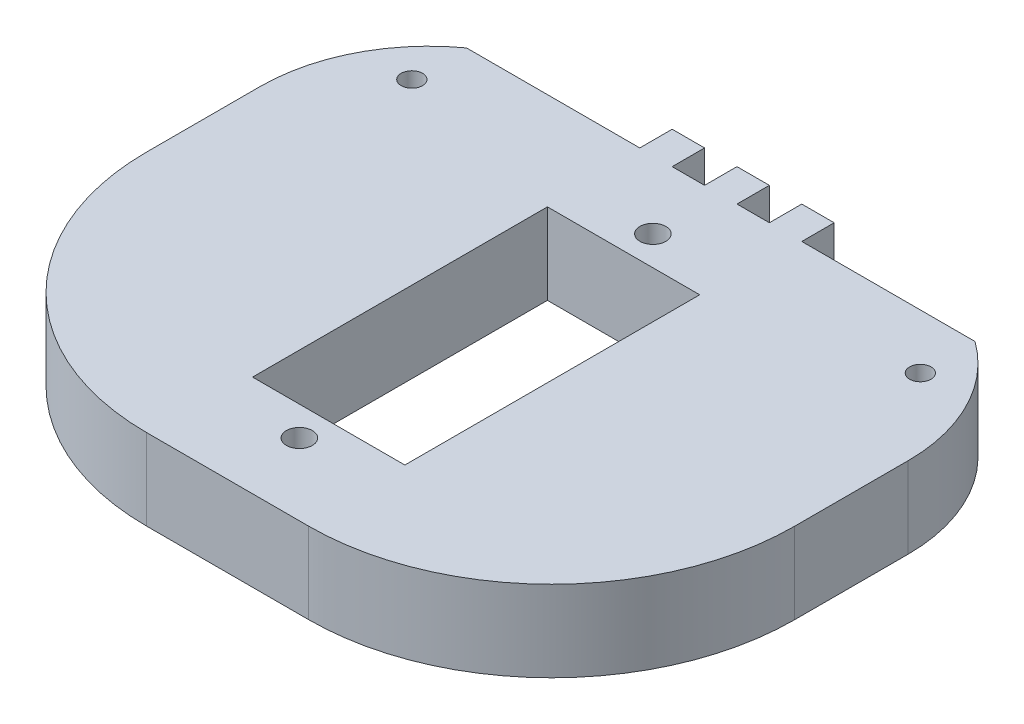
ISO-10303-21;
HEADER;
FILE_DESCRIPTION(('STEP AP214'),'2;1');
FILE_NAME('part.step','',(''),(''),'','','');
FILE_SCHEMA(('AUTOMOTIVE_DESIGN { 1 0 10303 214 1 1 1 1 }'));
ENDSEC;
DATA;
#1=APPLICATION_CONTEXT('core data for automotive mechanical design processes');
#2=APPLICATION_PROTOCOL_DEFINITION('international standard','automotive_design',2000,#1);
#3=PRODUCT_CONTEXT('',#1,'mechanical');
#4=PRODUCT('Part','Part','',(#3));
#5=PRODUCT_RELATED_PRODUCT_CATEGORY('part','',(#4));
#6=PRODUCT_DEFINITION_FORMATION('','',#4);
#7=PRODUCT_DEFINITION_CONTEXT('part definition',#1,'design');
#8=PRODUCT_DEFINITION('design','',#6,#7);
#9=PRODUCT_DEFINITION_SHAPE('','',#8);
#10=(LENGTH_UNIT() NAMED_UNIT(*) SI_UNIT(.MILLI.,.METRE.));
#11=(NAMED_UNIT(*) PLANE_ANGLE_UNIT() SI_UNIT($,.RADIAN.));
#12=(NAMED_UNIT(*) SI_UNIT($,.STERADIAN.) SOLID_ANGLE_UNIT());
#13=UNCERTAINTY_MEASURE_WITH_UNIT(LENGTH_MEASURE(1.E-05),#10,'distance_accuracy_value','');
#14=(GEOMETRIC_REPRESENTATION_CONTEXT(3) GLOBAL_UNCERTAINTY_ASSIGNED_CONTEXT((#13)) GLOBAL_UNIT_ASSIGNED_CONTEXT((#10,
#11,#12)) REPRESENTATION_CONTEXT('',''));
#15=CARTESIAN_POINT('',(0.,0.,0.));
#16=DIRECTION('',(0.,0.,1.));
#17=DIRECTION('',(1.,0.,0.));
#18=AXIS2_PLACEMENT_3D('',#15,#16,#17);
#19=CARTESIAN_POINT('',(37.5729287006509,6.35,-21.5900000000006));
#20=DIRECTION('',(0.,1.,0.));
#21=DIRECTION('',(0.,0.,1.));
#22=AXIS2_PLACEMENT_3D('',#19,#20,#21);
#23=PLANE('',#22);
#24=CARTESIAN_POINT('',(25.4,6.35,-26.983791346));
#25=DIRECTION('',(0.,1.,0.));
#26=DIRECTION('',(0.,0.,1.));
#27=AXIS2_PLACEMENT_3D('',#24,#25,#26);
#28=CIRCLE('',#27,1.016);
#29=CARTESIAN_POINT('',(25.4,6.35,-25.967791346));
#30=VERTEX_POINT('',#29);
#31=EDGE_CURVE('E737',#30,#30,#28,.T.);
#32=ORIENTED_EDGE('',*,*,#31,.F.);
#33=EDGE_LOOP('',(#32));
#34=FACE_BOUND('',#33,.T.);
#35=CARTESIAN_POINT('',(45.3298254592818,6.35,-28.017571346));
#36=DIRECTION('',(0.,1.,0.));
#37=DIRECTION('',(0.,0.,1.));
#38=AXIS2_PLACEMENT_3D('',#35,#36,#37);
#39=CIRCLE('',#38,0.840105000000002);
#40=CARTESIAN_POINT('',(45.3298254592818,6.35,-27.177466346));
#41=VERTEX_POINT('',#40);
#42=EDGE_CURVE('E224',#41,#41,#39,.T.);
#43=ORIENTED_EDGE('',*,*,#42,.F.);
#44=EDGE_LOOP('',(#43));
#45=FACE_BOUND('',#44,.T.);
#46=DIRECTION('',(-1.,0.,0.));
#47=VECTOR('',#46,1.);
#48=CARTESIAN_POINT('',(29.21,6.35,-34.843821346));
#49=LINE('',#48,#47);
#50=CARTESIAN_POINT('',(31.75,6.35,-34.843821346));
#51=VERTEX_POINT('',#50);
#52=CARTESIAN_POINT('',(29.21,6.35,-34.843821346));
#53=VERTEX_POINT('',#52);
#54=EDGE_CURVE('E234',#51,#53,#49,.T.);
#55=ORIENTED_EDGE('',*,*,#54,.T.);
#56=DIRECTION('',(0.,0.,1.));
#57=VECTOR('',#56,1.);
#58=CARTESIAN_POINT('',(29.21,6.35,-32.303821346));
#59=LINE('',#58,#57);
#60=CARTESIAN_POINT('',(29.21,6.35,-32.303821346));
#61=VERTEX_POINT('',#60);
#62=EDGE_CURVE('E237',#53,#61,#59,.T.);
#63=ORIENTED_EDGE('',*,*,#62,.T.);
#64=DIRECTION('',(-1.,0.,0.));
#65=VECTOR('',#64,1.);
#66=CARTESIAN_POINT('',(26.67,6.35,-32.303821346));
#67=LINE('',#66,#65);
#68=CARTESIAN_POINT('',(26.67,6.35,-32.303821346));
#69=VERTEX_POINT('',#68);
#70=EDGE_CURVE('E240',#61,#69,#67,.T.);
#71=ORIENTED_EDGE('',*,*,#70,.T.);
#72=DIRECTION('',(0.,0.,-1.));
#73=VECTOR('',#72,1.);
#74=CARTESIAN_POINT('',(26.67,6.35,-34.843821346));
#75=LINE('',#74,#73);
#76=CARTESIAN_POINT('',(26.67,6.35,-34.843821346));
#77=VERTEX_POINT('',#76);
#78=EDGE_CURVE('E242',#69,#77,#75,.T.);
#79=ORIENTED_EDGE('',*,*,#78,.T.);
#80=DIRECTION('',(-1.,0.,0.));
#81=VECTOR('',#80,1.);
#82=CARTESIAN_POINT('',(24.13,6.35,-34.843821346));
#83=LINE('',#82,#81);
#84=CARTESIAN_POINT('',(24.13,6.35,-34.843821346));
#85=VERTEX_POINT('',#84);
#86=EDGE_CURVE('E244',#77,#85,#83,.T.);
#87=ORIENTED_EDGE('',*,*,#86,.T.);
#88=DIRECTION('',(0.,0.,1.));
#89=VECTOR('',#88,1.);
#90=CARTESIAN_POINT('',(24.13,6.35,-34.843821346));
#91=LINE('',#90,#89);
#92=CARTESIAN_POINT('',(24.13,6.35,-32.303821346));
#93=VERTEX_POINT('',#92);
#94=EDGE_CURVE('E246',#85,#93,#91,.T.);
#95=ORIENTED_EDGE('',*,*,#94,.T.);
#96=DIRECTION('',(-1.,0.,0.));
#97=VECTOR('',#96,1.);
#98=CARTESIAN_POINT('',(24.13,6.35,-32.303821346));
#99=LINE('',#98,#97);
#100=CARTESIAN_POINT('',(21.59,6.35,-32.303821346));
#101=VERTEX_POINT('',#100);
#102=EDGE_CURVE('E248',#93,#101,#99,.T.);
#103=ORIENTED_EDGE('',*,*,#102,.T.);
#104=DIRECTION('',(0.,0.,-1.));
#105=VECTOR('',#104,1.);
#106=CARTESIAN_POINT('',(21.59,6.35,-32.303821346));
#107=LINE('',#106,#105);
#108=CARTESIAN_POINT('',(21.59,6.35,-34.843821346));
#109=VERTEX_POINT('',#108);
#110=EDGE_CURVE('E250',#101,#109,#107,.T.);
#111=ORIENTED_EDGE('',*,*,#110,.T.);
#112=DIRECTION('',(-1.,0.,0.));
#113=VECTOR('',#112,1.);
#114=CARTESIAN_POINT('',(21.59,6.35,-34.843821346));
#115=LINE('',#114,#113);
#116=CARTESIAN_POINT('',(19.05,6.35,-34.843821346));
#117=VERTEX_POINT('',#116);
#118=EDGE_CURVE('E252',#109,#117,#115,.T.);
#119=ORIENTED_EDGE('',*,*,#118,.T.);
#120=DIRECTION('',(0.,0.,1.));
#121=VECTOR('',#120,1.);
#122=CARTESIAN_POINT('',(19.05,6.35,-34.843821346));
#123=LINE('',#122,#121);
#124=CARTESIAN_POINT('',(19.05,6.35,-32.303821346));
#125=VERTEX_POINT('',#124);
#126=EDGE_CURVE('E254',#117,#125,#123,.T.);
#127=ORIENTED_EDGE('',*,*,#126,.T.);
#128=DIRECTION('',(-1.,0.,0.));
#129=VECTOR('',#128,1.);
#130=CARTESIAN_POINT('',(19.05,6.35,-32.303821346));
#131=LINE('',#130,#129);
#132=CARTESIAN_POINT('',(5.47017454071819,6.35,-32.303821346));
#133=VERTEX_POINT('',#132);
#134=EDGE_CURVE('E256',#125,#133,#131,.T.);
#135=ORIENTED_EDGE('',*,*,#134,.T.);
#136=CARTESIAN_POINT('',(13.227071299349,6.35,-21.59));
#137=DIRECTION('',(0.,1.,0.));
#138=DIRECTION('',(0.,0.,-1.));
#139=AXIS2_PLACEMENT_3D('',#136,#137,#138);
#140=CIRCLE('',#139,13.227071299349);
#141=CARTESIAN_POINT('',(0.,6.35,-21.59));
#142=VERTEX_POINT('',#141);
#143=EDGE_CURVE('E258',#133,#142,#140,.T.);
#144=ORIENTED_EDGE('',*,*,#143,.T.);
#145=DIRECTION('',(0.,0.,1.));
#146=VECTOR('',#145,1.);
#147=CARTESIAN_POINT('',(0.,6.35,-12.7));
#148=LINE('',#147,#146);
#149=CARTESIAN_POINT('',(0.,6.35,-12.7));
#150=VERTEX_POINT('',#149);
#151=EDGE_CURVE('E260',#142,#150,#148,.T.);
#152=ORIENTED_EDGE('',*,*,#151,.T.);
#153=CARTESIAN_POINT('',(19.05,6.35,-12.7));
#154=DIRECTION('',(0.,1.,0.));
#155=DIRECTION('',(0.,0.,1.));
#156=AXIS2_PLACEMENT_3D('',#153,#154,#155);
#157=CIRCLE('',#156,19.05);
#158=CARTESIAN_POINT('',(19.05,6.35,6.34999999999996));
#159=VERTEX_POINT('',#158);
#160=EDGE_CURVE('E262',#150,#159,#157,.T.);
#161=ORIENTED_EDGE('',*,*,#160,.T.);
#162=DIRECTION('',(1.,0.,0.));
#163=VECTOR('',#162,1.);
#164=CARTESIAN_POINT('',(19.0500000000001,6.35,6.34999999999996));
#165=LINE('',#164,#163);
#166=CARTESIAN_POINT('',(31.75,6.35,6.35));
#167=VERTEX_POINT('',#166);
#168=EDGE_CURVE('E264',#159,#167,#165,.T.);
#169=ORIENTED_EDGE('',*,*,#168,.T.);
#170=CARTESIAN_POINT('',(31.75,6.35,-12.7));
#171=DIRECTION('',(0.,1.,0.));
#172=DIRECTION('',(0.,0.,1.));
#173=AXIS2_PLACEMENT_3D('',#170,#171,#172);
#174=CIRCLE('',#173,19.05);
#175=CARTESIAN_POINT('',(50.8,6.35,-12.7000000000006));
#176=VERTEX_POINT('',#175);
#177=EDGE_CURVE('E266',#167,#176,#174,.T.);
#178=ORIENTED_EDGE('',*,*,#177,.T.);
#179=DIRECTION('',(0.,0.,-1.));
#180=VECTOR('',#179,1.);
#181=CARTESIAN_POINT('',(50.8,6.35,-12.7000000000006));
#182=LINE('',#181,#180);
#183=CARTESIAN_POINT('',(50.8,6.35,-21.5900000000006));
#184=VERTEX_POINT('',#183);
#185=EDGE_CURVE('E268',#176,#184,#182,.T.);
#186=ORIENTED_EDGE('',*,*,#185,.T.);
#187=CARTESIAN_POINT('',(37.5729287006509,6.35,-21.5900000000006));
#188=DIRECTION('',(0.,1.,0.));
#189=DIRECTION('',(0.,0.,1.));
#190=AXIS2_PLACEMENT_3D('',#187,#188,#189);
#191=CIRCLE('',#190,13.2270712993491);
#192=CARTESIAN_POINT('',(45.3298254592818,6.35,-32.3038213460006));
#193=VERTEX_POINT('',#192);
#194=EDGE_CURVE('E270',#184,#193,#191,.T.);
#195=ORIENTED_EDGE('',*,*,#194,.T.);
#196=DIRECTION('',(-1.,0.,0.));
#197=VECTOR('',#196,1.);
#198=CARTESIAN_POINT('',(31.75,6.35,-32.3038213460006));
#199=LINE('',#198,#197);
#200=CARTESIAN_POINT('',(31.75,6.35,-32.3038213460006));
#201=VERTEX_POINT('',#200);
#202=EDGE_CURVE('E272',#193,#201,#199,.T.);
#203=ORIENTED_EDGE('',*,*,#202,.T.);
#204=DIRECTION('',(0.,0.,-1.));
#205=VECTOR('',#204,1.);
#206=CARTESIAN_POINT('',(31.75,6.35,-34.843821346));
#207=LINE('',#206,#205);
#208=EDGE_CURVE('E274',#201,#51,#207,.T.);
#209=ORIENTED_EDGE('',*,*,#208,.T.);
#210=EDGE_LOOP('',(#55,#63,#71,#79,#87,#95,#103,#111,#119,#127,#135,#144,#152,#161,#169,#178,
#186,#195,#203,#209));
#211=FACE_BOUND('',#210,.T.);
#212=DIRECTION('',(0.,0.,-1.));
#213=VECTOR('',#212,1.);
#214=CARTESIAN_POINT('',(31.369,6.35,-1.569821346));
#215=LINE('',#214,#213);
#216=CARTESIAN_POINT('',(31.369,6.35,-1.569821346));
#217=VERTEX_POINT('',#216);
#218=CARTESIAN_POINT('',(31.369,6.35,-24.683821346));
#219=VERTEX_POINT('',#218);
#220=EDGE_CURVE('E202',#217,#219,#215,.T.);
#221=ORIENTED_EDGE('',*,*,#220,.F.);
#222=DIRECTION('',(1.,0.,0.));
#223=VECTOR('',#222,1.);
#224=CARTESIAN_POINT('',(19.431,6.35,-1.569821346));
#225=LINE('',#224,#223);
#226=CARTESIAN_POINT('',(19.431,6.35,-1.569821346));
#227=VERTEX_POINT('',#226);
#228=EDGE_CURVE('E194',#227,#217,#225,.T.);
#229=ORIENTED_EDGE('',*,*,#228,.F.);
#230=DIRECTION('',(0.,0.,1.));
#231=VECTOR('',#230,1.);
#232=CARTESIAN_POINT('',(19.431,6.35,-24.683821346));
#233=LINE('',#232,#231);
#234=CARTESIAN_POINT('',(19.431,6.35,-24.683821346));
#235=VERTEX_POINT('',#234);
#236=EDGE_CURVE('E218',#235,#227,#233,.T.);
#237=ORIENTED_EDGE('',*,*,#236,.F.);
#238=DIRECTION('',(-1.,0.,0.));
#239=VECTOR('',#238,1.);
#240=CARTESIAN_POINT('',(25.4,6.35,-24.683821346));
#241=LINE('',#240,#239);
#242=EDGE_CURVE('E216',#219,#235,#241,.T.);
#243=ORIENTED_EDGE('',*,*,#242,.F.);
#244=EDGE_LOOP('',(#221,#229,#237,#243));
#245=FACE_BOUND('',#244,.T.);
#246=CARTESIAN_POINT('',(5.47017448000002,6.35,-28.017571346));
#247=DIRECTION('',(0.,1.,0.));
#248=DIRECTION('',(0.,0.,1.));
#249=AXIS2_PLACEMENT_3D('',#246,#247,#248);
#250=CIRCLE('',#249,0.840105);
#251=CARTESIAN_POINT('',(5.47017448000002,6.35,-27.177466346));
#252=VERTEX_POINT('',#251);
#253=EDGE_CURVE('E743',#252,#252,#250,.T.);
#254=ORIENTED_EDGE('',*,*,#253,.F.);
#255=EDGE_LOOP('',(#254));
#256=FACE_BOUND('',#255,.T.);
#257=CARTESIAN_POINT('',(25.4,6.35,0.730148654000005));
#258=DIRECTION('',(0.,1.,0.));
#259=DIRECTION('',(0.,0.,1.));
#260=AXIS2_PLACEMENT_3D('',#257,#258,#259);
#261=CIRCLE('',#260,1.016);
#262=CARTESIAN_POINT('',(25.4,6.35,1.74614865400001));
#263=VERTEX_POINT('',#262);
#264=EDGE_CURVE('E728',#263,#263,#261,.T.);
#265=ORIENTED_EDGE('',*,*,#264,.F.);
#266=EDGE_LOOP('',(#265));
#267=FACE_BOUND('',#266,.T.);
#268=ADVANCED_FACE('F33',(#34,#45,#211,#245,#256,#267),#23,.T.);
#269=CARTESIAN_POINT('',(37.5729287006509,0.,-21.5900000000006));
#270=DIRECTION('',(0.,1.,0.));
#271=DIRECTION('',(0.,0.,1.));
#272=AXIS2_PLACEMENT_3D('',#269,#270,#271);
#273=PLANE('',#272);
#274=DIRECTION('',(-1.,0.,0.));
#275=VECTOR('',#274,1.);
#276=CARTESIAN_POINT('',(29.21,0.,-34.843821346));
#277=LINE('',#276,#275);
#278=CARTESIAN_POINT('',(31.75,0.,-34.843821346));
#279=VERTEX_POINT('',#278);
#280=CARTESIAN_POINT('',(29.21,0.,-34.843821346));
#281=VERTEX_POINT('',#280);
#282=EDGE_CURVE('E211',#279,#281,#277,.T.);
#283=ORIENTED_EDGE('',*,*,#282,.F.);
#284=DIRECTION('',(0.,0.,-1.));
#285=VECTOR('',#284,1.);
#286=CARTESIAN_POINT('',(31.75,0.,-34.843821346));
#287=LINE('',#286,#285);
#288=CARTESIAN_POINT('',(31.75,0.,-32.3038213460006));
#289=VERTEX_POINT('',#288);
#290=EDGE_CURVE('E238',#289,#279,#287,.T.);
#291=ORIENTED_EDGE('',*,*,#290,.F.);
#292=DIRECTION('',(-1.,0.,0.));
#293=VECTOR('',#292,1.);
#294=CARTESIAN_POINT('',(31.75,0.,-32.3038213460006));
#295=LINE('',#294,#293);
#296=CARTESIAN_POINT('',(45.3298254592818,0.,-32.3038213460006));
#297=VERTEX_POINT('',#296);
#298=EDGE_CURVE('E313',#297,#289,#295,.T.);
#299=ORIENTED_EDGE('',*,*,#298,.F.);
#300=CARTESIAN_POINT('',(37.5729287006509,0.,-21.5900000000006));
#301=DIRECTION('',(0.,1.,0.));
#302=DIRECTION('',(0.,0.,1.));
#303=AXIS2_PLACEMENT_3D('',#300,#301,#302);
#304=CIRCLE('',#303,13.2270712993491);
#305=CARTESIAN_POINT('',(50.8,0.,-21.5900000000006));
#306=VERTEX_POINT('',#305);
#307=EDGE_CURVE('E311',#306,#297,#304,.T.);
#308=ORIENTED_EDGE('',*,*,#307,.F.);
#309=DIRECTION('',(0.,0.,-1.));
#310=VECTOR('',#309,1.);
#311=CARTESIAN_POINT('',(50.8,0.,-12.7000000000006));
#312=LINE('',#311,#310);
#313=CARTESIAN_POINT('',(50.8,0.,-12.7000000000006));
#314=VERTEX_POINT('',#313);
#315=EDGE_CURVE('E309',#314,#306,#312,.T.);
#316=ORIENTED_EDGE('',*,*,#315,.F.);
#317=CARTESIAN_POINT('',(31.75,0.,-12.7));
#318=DIRECTION('',(0.,1.,0.));
#319=DIRECTION('',(0.,0.,1.));
#320=AXIS2_PLACEMENT_3D('',#317,#318,#319);
#321=CIRCLE('',#320,19.05);
#322=CARTESIAN_POINT('',(31.75,0.,6.35));
#323=VERTEX_POINT('',#322);
#324=EDGE_CURVE('E307',#323,#314,#321,.T.);
#325=ORIENTED_EDGE('',*,*,#324,.F.);
#326=DIRECTION('',(1.,0.,0.));
#327=VECTOR('',#326,1.);
#328=CARTESIAN_POINT('',(19.0500000000001,0.,6.34999999999996));
#329=LINE('',#328,#327);
#330=CARTESIAN_POINT('',(19.05,0.,6.34999999999996));
#331=VERTEX_POINT('',#330);
#332=EDGE_CURVE('E305',#331,#323,#329,.T.);
#333=ORIENTED_EDGE('',*,*,#332,.F.);
#334=CARTESIAN_POINT('',(19.05,0.,-12.7));
#335=DIRECTION('',(0.,1.,0.));
#336=DIRECTION('',(0.,0.,1.));
#337=AXIS2_PLACEMENT_3D('',#334,#335,#336);
#338=CIRCLE('',#337,19.05);
#339=CARTESIAN_POINT('',(0.,0.,-12.7));
#340=VERTEX_POINT('',#339);
#341=EDGE_CURVE('E303',#340,#331,#338,.T.);
#342=ORIENTED_EDGE('',*,*,#341,.F.);
#343=DIRECTION('',(0.,0.,1.));
#344=VECTOR('',#343,1.);
#345=CARTESIAN_POINT('',(0.,0.,-12.7));
#346=LINE('',#345,#344);
#347=CARTESIAN_POINT('',(0.,0.,-21.59));
#348=VERTEX_POINT('',#347);
#349=EDGE_CURVE('E301',#348,#340,#346,.T.);
#350=ORIENTED_EDGE('',*,*,#349,.F.);
#351=CARTESIAN_POINT('',(13.227071299349,0.,-21.59));
#352=DIRECTION('',(0.,1.,0.));
#353=DIRECTION('',(0.,0.,-1.));
#354=AXIS2_PLACEMENT_3D('',#351,#352,#353);
#355=CIRCLE('',#354,13.227071299349);
#356=CARTESIAN_POINT('',(5.47017454071819,0.,-32.303821346));
#357=VERTEX_POINT('',#356);
#358=EDGE_CURVE('E299',#357,#348,#355,.T.);
#359=ORIENTED_EDGE('',*,*,#358,.F.);
#360=DIRECTION('',(-1.,0.,0.));
#361=VECTOR('',#360,1.);
#362=CARTESIAN_POINT('',(19.05,0.,-32.303821346));
#363=LINE('',#362,#361);
#364=CARTESIAN_POINT('',(19.05,0.,-32.303821346));
#365=VERTEX_POINT('',#364);
#366=EDGE_CURVE('E297',#365,#357,#363,.T.);
#367=ORIENTED_EDGE('',*,*,#366,.F.);
#368=DIRECTION('',(0.,0.,1.));
#369=VECTOR('',#368,1.);
#370=CARTESIAN_POINT('',(19.05,0.,-34.843821346));
#371=LINE('',#370,#369);
#372=CARTESIAN_POINT('',(19.05,0.,-34.843821346));
#373=VERTEX_POINT('',#372);
#374=EDGE_CURVE('E295',#373,#365,#371,.T.);
#375=ORIENTED_EDGE('',*,*,#374,.F.);
#376=DIRECTION('',(-1.,0.,0.));
#377=VECTOR('',#376,1.);
#378=CARTESIAN_POINT('',(21.59,0.,-34.843821346));
#379=LINE('',#378,#377);
#380=CARTESIAN_POINT('',(21.59,0.,-34.843821346));
#381=VERTEX_POINT('',#380);
#382=EDGE_CURVE('E293',#381,#373,#379,.T.);
#383=ORIENTED_EDGE('',*,*,#382,.F.);
#384=DIRECTION('',(0.,0.,-1.));
#385=VECTOR('',#384,1.);
#386=CARTESIAN_POINT('',(21.59,0.,-32.303821346));
#387=LINE('',#386,#385);
#388=CARTESIAN_POINT('',(21.59,0.,-32.303821346));
#389=VERTEX_POINT('',#388);
#390=EDGE_CURVE('E291',#389,#381,#387,.T.);
#391=ORIENTED_EDGE('',*,*,#390,.F.);
#392=DIRECTION('',(-1.,0.,0.));
#393=VECTOR('',#392,1.);
#394=CARTESIAN_POINT('',(24.13,0.,-32.303821346));
#395=LINE('',#394,#393);
#396=CARTESIAN_POINT('',(24.13,0.,-32.303821346));
#397=VERTEX_POINT('',#396);
#398=EDGE_CURVE('E289',#397,#389,#395,.T.);
#399=ORIENTED_EDGE('',*,*,#398,.F.);
#400=DIRECTION('',(0.,0.,1.));
#401=VECTOR('',#400,1.);
#402=CARTESIAN_POINT('',(24.13,0.,-34.843821346));
#403=LINE('',#402,#401);
#404=CARTESIAN_POINT('',(24.13,0.,-34.843821346));
#405=VERTEX_POINT('',#404);
#406=EDGE_CURVE('E287',#405,#397,#403,.T.);
#407=ORIENTED_EDGE('',*,*,#406,.F.);
#408=DIRECTION('',(-1.,0.,0.));
#409=VECTOR('',#408,1.);
#410=CARTESIAN_POINT('',(24.13,0.,-34.843821346));
#411=LINE('',#410,#409);
#412=CARTESIAN_POINT('',(26.67,0.,-34.843821346));
#413=VERTEX_POINT('',#412);
#414=EDGE_CURVE('E285',#413,#405,#411,.T.);
#415=ORIENTED_EDGE('',*,*,#414,.F.);
#416=DIRECTION('',(0.,0.,-1.));
#417=VECTOR('',#416,1.);
#418=CARTESIAN_POINT('',(26.67,0.,-34.843821346));
#419=LINE('',#418,#417);
#420=CARTESIAN_POINT('',(26.67,0.,-32.303821346));
#421=VERTEX_POINT('',#420);
#422=EDGE_CURVE('E283',#421,#413,#419,.T.);
#423=ORIENTED_EDGE('',*,*,#422,.F.);
#424=DIRECTION('',(-1.,0.,0.));
#425=VECTOR('',#424,1.);
#426=CARTESIAN_POINT('',(26.67,0.,-32.303821346));
#427=LINE('',#426,#425);
#428=CARTESIAN_POINT('',(29.21,0.,-32.303821346));
#429=VERTEX_POINT('',#428);
#430=EDGE_CURVE('E281',#429,#421,#427,.T.);
#431=ORIENTED_EDGE('',*,*,#430,.F.);
#432=DIRECTION('',(0.,0.,1.));
#433=VECTOR('',#432,1.);
#434=CARTESIAN_POINT('',(29.21,0.,-32.303821346));
#435=LINE('',#434,#433);
#436=EDGE_CURVE('E279',#281,#429,#435,.T.);
#437=ORIENTED_EDGE('',*,*,#436,.F.);
#438=EDGE_LOOP('',(#283,#291,#299,#308,#316,#325,#333,#342,#350,#359,#367,#375,#383,#391,#399,
#407,#415,#423,#431,#437));
#439=FACE_BOUND('',#438,.T.);
#440=DIRECTION('',(1.,0.,0.));
#441=VECTOR('',#440,1.);
#442=CARTESIAN_POINT('',(19.431,0.,-1.569821346));
#443=LINE('',#442,#441);
#444=CARTESIAN_POINT('',(19.431,0.,-1.569821346));
#445=VERTEX_POINT('',#444);
#446=CARTESIAN_POINT('',(31.369,0.,-1.569821346));
#447=VERTEX_POINT('',#446);
#448=EDGE_CURVE('E56',#445,#447,#443,.T.);
#449=ORIENTED_EDGE('',*,*,#448,.T.);
#450=DIRECTION('',(0.,0.,-1.));
#451=VECTOR('',#450,1.);
#452=CARTESIAN_POINT('',(31.369,0.,-1.569821346));
#453=LINE('',#452,#451);
#454=CARTESIAN_POINT('',(31.369,0.,-24.683821346));
#455=VERTEX_POINT('',#454);
#456=EDGE_CURVE('E210',#447,#455,#453,.T.);
#457=ORIENTED_EDGE('',*,*,#456,.T.);
#458=DIRECTION('',(-1.,0.,0.));
#459=VECTOR('',#458,1.);
#460=CARTESIAN_POINT('',(25.4,0.,-24.683821346));
#461=LINE('',#460,#459);
#462=CARTESIAN_POINT('',(19.431,0.,-24.683821346));
#463=VERTEX_POINT('',#462);
#464=EDGE_CURVE('E226',#455,#463,#461,.T.);
#465=ORIENTED_EDGE('',*,*,#464,.T.);
#466=DIRECTION('',(0.,0.,1.));
#467=VECTOR('',#466,1.);
#468=CARTESIAN_POINT('',(19.431,0.,-24.683821346));
#469=LINE('',#468,#467);
#470=EDGE_CURVE('E203',#463,#445,#469,.T.);
#471=ORIENTED_EDGE('',*,*,#470,.T.);
#472=EDGE_LOOP('',(#449,#457,#465,#471));
#473=FACE_BOUND('',#472,.T.);
#474=CARTESIAN_POINT('',(45.3298254592818,0.,-28.017571346));
#475=DIRECTION('',(0.,1.,0.));
#476=DIRECTION('',(0.,0.,1.));
#477=AXIS2_PLACEMENT_3D('',#474,#475,#476);
#478=CIRCLE('',#477,0.840105000000002);
#479=CARTESIAN_POINT('',(45.3298254592818,0.,-27.177466346));
#480=VERTEX_POINT('',#479);
#481=EDGE_CURVE('E746',#480,#480,#478,.T.);
#482=ORIENTED_EDGE('',*,*,#481,.T.);
#483=EDGE_LOOP('',(#482));
#484=FACE_BOUND('',#483,.T.);
#485=CARTESIAN_POINT('',(5.47017448000002,0.,-28.017571346));
#486=DIRECTION('',(0.,1.,0.));
#487=DIRECTION('',(0.,0.,1.));
#488=AXIS2_PLACEMENT_3D('',#485,#486,#487);
#489=CIRCLE('',#488,0.840105);
#490=CARTESIAN_POINT('',(5.47017448000002,0.,-27.177466346));
#491=VERTEX_POINT('',#490);
#492=EDGE_CURVE('E740',#491,#491,#489,.T.);
#493=ORIENTED_EDGE('',*,*,#492,.T.);
#494=EDGE_LOOP('',(#493));
#495=FACE_BOUND('',#494,.T.);
#496=CARTESIAN_POINT('',(25.4,0.,-26.983791346));
#497=DIRECTION('',(0.,1.,0.));
#498=DIRECTION('',(0.,0.,1.));
#499=AXIS2_PLACEMENT_3D('',#496,#497,#498);
#500=CIRCLE('',#499,1.016);
#501=CARTESIAN_POINT('',(25.4,0.,-25.967791346));
#502=VERTEX_POINT('',#501);
#503=EDGE_CURVE('E734',#502,#502,#500,.T.);
#504=ORIENTED_EDGE('',*,*,#503,.T.);
#505=EDGE_LOOP('',(#504));
#506=FACE_BOUND('',#505,.T.);
#507=CARTESIAN_POINT('',(25.4,0.,0.730148654000005));
#508=DIRECTION('',(0.,1.,0.));
#509=DIRECTION('',(0.,0.,1.));
#510=AXIS2_PLACEMENT_3D('',#507,#508,#509);
#511=CIRCLE('',#510,1.016);
#512=CARTESIAN_POINT('',(25.4,0.,1.74614865400001));
#513=VERTEX_POINT('',#512);
#514=EDGE_CURVE('E731',#513,#513,#511,.T.);
#515=ORIENTED_EDGE('',*,*,#514,.T.);
#516=EDGE_LOOP('',(#515));
#517=FACE_BOUND('',#516,.T.);
#518=ADVANCED_FACE('F379',(#439,#473,#484,#495,#506,#517),#273,.F.);
#519=CARTESIAN_POINT('',(29.21,6.35,-34.843821346));
#520=DIRECTION('',(0.,0.,1.));
#521=DIRECTION('',(1.,0.,0.));
#522=AXIS2_PLACEMENT_3D('',#519,#520,#521);
#523=PLANE('',#522);
#524=ORIENTED_EDGE('',*,*,#282,.T.);
#525=DIRECTION('',(0.,-1.,0.));
#526=VECTOR('',#525,1.);
#527=CARTESIAN_POINT('',(29.21,6.35,-34.843821346));
#528=LINE('',#527,#526);
#529=EDGE_CURVE('E11',#53,#281,#528,.T.);
#530=ORIENTED_EDGE('',*,*,#529,.F.);
#531=ORIENTED_EDGE('',*,*,#54,.F.);
#532=DIRECTION('',(0.,-1.,0.));
#533=VECTOR('',#532,1.);
#534=CARTESIAN_POINT('',(31.75,6.35,-34.843821346));
#535=LINE('',#534,#533);
#536=EDGE_CURVE('E276',#51,#279,#535,.T.);
#537=ORIENTED_EDGE('',*,*,#536,.T.);
#538=EDGE_LOOP('',(#524,#530,#531,#537));
#539=FACE_BOUND('',#538,.T.);
#540=ADVANCED_FACE('F35',(#539),#523,.F.);
#541=CARTESIAN_POINT('',(29.21,6.35,-32.303821346));
#542=DIRECTION('',(1.,0.,0.));
#543=DIRECTION('',(0.,0.,-1.));
#544=AXIS2_PLACEMENT_3D('',#541,#542,#543);
#545=PLANE('',#544);
#546=ORIENTED_EDGE('',*,*,#436,.T.);
#547=DIRECTION('',(0.,-1.,0.));
#548=VECTOR('',#547,1.);
#549=CARTESIAN_POINT('',(29.21,6.35,-32.303821346));
#550=LINE('',#549,#548);
#551=EDGE_CURVE('E41',#61,#429,#550,.T.);
#552=ORIENTED_EDGE('',*,*,#551,.F.);
#553=ORIENTED_EDGE('',*,*,#62,.F.);
#554=ORIENTED_EDGE('',*,*,#529,.T.);
#555=EDGE_LOOP('',(#546,#552,#553,#554));
#556=FACE_BOUND('',#555,.T.);
#557=ADVANCED_FACE('F396',(#556),#545,.F.);
#558=CARTESIAN_POINT('',(26.67,6.35,-32.303821346));
#559=DIRECTION('',(0.,0.,1.));
#560=DIRECTION('',(1.,0.,0.));
#561=AXIS2_PLACEMENT_3D('',#558,#559,#560);
#562=PLANE('',#561);
#563=ORIENTED_EDGE('',*,*,#430,.T.);
#564=DIRECTION('',(0.,-1.,0.));
#565=VECTOR('',#564,1.);
#566=CARTESIAN_POINT('',(26.67,6.35,-32.303821346));
#567=LINE('',#566,#565);
#568=EDGE_CURVE('E366',#69,#421,#567,.T.);
#569=ORIENTED_EDGE('',*,*,#568,.F.);
#570=ORIENTED_EDGE('',*,*,#70,.F.);
#571=ORIENTED_EDGE('',*,*,#551,.T.);
#572=EDGE_LOOP('',(#563,#569,#570,#571));
#573=FACE_BOUND('',#572,.T.);
#574=ADVANCED_FACE('F373',(#573),#562,.F.);
#575=CARTESIAN_POINT('',(26.67,6.35,-34.843821346));
#576=DIRECTION('',(-1.,0.,0.));
#577=DIRECTION('',(0.,0.,1.));
#578=AXIS2_PLACEMENT_3D('',#575,#576,#577);
#579=PLANE('',#578);
#580=ORIENTED_EDGE('',*,*,#422,.T.);
#581=DIRECTION('',(0.,-1.,0.));
#582=VECTOR('',#581,1.);
#583=CARTESIAN_POINT('',(26.67,6.35,-34.843821346));
#584=LINE('',#583,#582);
#585=EDGE_CURVE('E363',#77,#413,#584,.T.);
#586=ORIENTED_EDGE('',*,*,#585,.F.);
#587=ORIENTED_EDGE('',*,*,#78,.F.);
#588=ORIENTED_EDGE('',*,*,#568,.T.);
#589=EDGE_LOOP('',(#580,#586,#587,#588));
#590=FACE_BOUND('',#589,.T.);
#591=ADVANCED_FACE('F385',(#590),#579,.F.);
#592=CARTESIAN_POINT('',(24.13,6.35,-34.843821346));
#593=DIRECTION('',(0.,0.,1.));
#594=DIRECTION('',(1.,0.,0.));
#595=AXIS2_PLACEMENT_3D('',#592,#593,#594);
#596=PLANE('',#595);
#597=ORIENTED_EDGE('',*,*,#414,.T.);
#598=DIRECTION('',(0.,-1.,0.));
#599=VECTOR('',#598,1.);
#600=CARTESIAN_POINT('',(24.13,6.35,-34.843821346));
#601=LINE('',#600,#599);
#602=EDGE_CURVE('E360',#85,#405,#601,.T.);
#603=ORIENTED_EDGE('',*,*,#602,.F.);
#604=ORIENTED_EDGE('',*,*,#86,.F.);
#605=ORIENTED_EDGE('',*,*,#585,.T.);
#606=EDGE_LOOP('',(#597,#603,#604,#605));
#607=FACE_BOUND('',#606,.T.);
#608=ADVANCED_FACE('F389',(#607),#596,.F.);
#609=CARTESIAN_POINT('',(24.13,6.35,-34.843821346));
#610=DIRECTION('',(1.,0.,0.));
#611=DIRECTION('',(0.,0.,-1.));
#612=AXIS2_PLACEMENT_3D('',#609,#610,#611);
#613=PLANE('',#612);
#614=ORIENTED_EDGE('',*,*,#406,.T.);
#615=DIRECTION('',(0.,-1.,0.));
#616=VECTOR('',#615,1.);
#617=CARTESIAN_POINT('',(24.13,6.35,-32.303821346));
#618=LINE('',#617,#616);
#619=EDGE_CURVE('E357',#93,#397,#618,.T.);
#620=ORIENTED_EDGE('',*,*,#619,.F.);
#621=ORIENTED_EDGE('',*,*,#94,.F.);
#622=ORIENTED_EDGE('',*,*,#602,.T.);
#623=EDGE_LOOP('',(#614,#620,#621,#622));
#624=FACE_BOUND('',#623,.T.);
#625=ADVANCED_FACE('F469',(#624),#613,.F.);
#626=CARTESIAN_POINT('',(24.13,6.35,-32.303821346));
#627=DIRECTION('',(0.,0.,1.));
#628=DIRECTION('',(1.,0.,0.));
#629=AXIS2_PLACEMENT_3D('',#626,#627,#628);
#630=PLANE('',#629);
#631=ORIENTED_EDGE('',*,*,#398,.T.);
#632=DIRECTION('',(0.,-1.,0.));
#633=VECTOR('',#632,1.);
#634=CARTESIAN_POINT('',(21.59,6.35,-32.303821346));
#635=LINE('',#634,#633);
#636=EDGE_CURVE('E354',#101,#389,#635,.T.);
#637=ORIENTED_EDGE('',*,*,#636,.F.);
#638=ORIENTED_EDGE('',*,*,#102,.F.);
#639=ORIENTED_EDGE('',*,*,#619,.T.);
#640=EDGE_LOOP('',(#631,#637,#638,#639));
#641=FACE_BOUND('',#640,.T.);
#642=ADVANCED_FACE('F467',(#641),#630,.F.);
#643=CARTESIAN_POINT('',(21.59,6.35,-32.303821346));
#644=DIRECTION('',(-1.,0.,0.));
#645=DIRECTION('',(0.,0.,1.));
#646=AXIS2_PLACEMENT_3D('',#643,#644,#645);
#647=PLANE('',#646);
#648=ORIENTED_EDGE('',*,*,#390,.T.);
#649=DIRECTION('',(0.,-1.,0.));
#650=VECTOR('',#649,1.);
#651=CARTESIAN_POINT('',(21.59,6.35,-34.843821346));
#652=LINE('',#651,#650);
#653=EDGE_CURVE('E351',#109,#381,#652,.T.);
#654=ORIENTED_EDGE('',*,*,#653,.F.);
#655=ORIENTED_EDGE('',*,*,#110,.F.);
#656=ORIENTED_EDGE('',*,*,#636,.T.);
#657=EDGE_LOOP('',(#648,#654,#655,#656));
#658=FACE_BOUND('',#657,.T.);
#659=ADVANCED_FACE('F462',(#658),#647,.F.);
#660=CARTESIAN_POINT('',(21.59,6.35,-34.843821346));
#661=DIRECTION('',(0.,0.,1.));
#662=DIRECTION('',(1.,0.,0.));
#663=AXIS2_PLACEMENT_3D('',#660,#661,#662);
#664=PLANE('',#663);
#665=ORIENTED_EDGE('',*,*,#382,.T.);
#666=DIRECTION('',(0.,-1.,0.));
#667=VECTOR('',#666,1.);
#668=CARTESIAN_POINT('',(19.05,6.35,-34.843821346));
#669=LINE('',#668,#667);
#670=EDGE_CURVE('E348',#117,#373,#669,.T.);
#671=ORIENTED_EDGE('',*,*,#670,.F.);
#672=ORIENTED_EDGE('',*,*,#118,.F.);
#673=ORIENTED_EDGE('',*,*,#653,.T.);
#674=EDGE_LOOP('',(#665,#671,#672,#673));
#675=FACE_BOUND('',#674,.T.);
#676=ADVANCED_FACE('F457',(#675),#664,.F.);
#677=CARTESIAN_POINT('',(19.05,6.35,-34.843821346));
#678=DIRECTION('',(1.,0.,0.));
#679=DIRECTION('',(0.,0.,-1.));
#680=AXIS2_PLACEMENT_3D('',#677,#678,#679);
#681=PLANE('',#680);
#682=ORIENTED_EDGE('',*,*,#374,.T.);
#683=DIRECTION('',(0.,-1.,0.));
#684=VECTOR('',#683,1.);
#685=CARTESIAN_POINT('',(19.05,6.35,-32.303821346));
#686=LINE('',#685,#684);
#687=EDGE_CURVE('E345',#125,#365,#686,.T.);
#688=ORIENTED_EDGE('',*,*,#687,.F.);
#689=ORIENTED_EDGE('',*,*,#126,.F.);
#690=ORIENTED_EDGE('',*,*,#670,.T.);
#691=EDGE_LOOP('',(#682,#688,#689,#690));
#692=FACE_BOUND('',#691,.T.);
#693=ADVANCED_FACE('F453',(#692),#681,.F.);
#694=CARTESIAN_POINT('',(19.05,6.35,-32.303821346));
#695=DIRECTION('',(0.,0.,1.));
#696=DIRECTION('',(1.,0.,0.));
#697=AXIS2_PLACEMENT_3D('',#694,#695,#696);
#698=PLANE('',#697);
#699=ORIENTED_EDGE('',*,*,#366,.T.);
#700=DIRECTION('',(0.,-1.,0.));
#701=VECTOR('',#700,1.);
#702=CARTESIAN_POINT('',(5.47017454071819,6.35,-32.303821346));
#703=LINE('',#702,#701);
#704=EDGE_CURVE('E342',#133,#357,#703,.T.);
#705=ORIENTED_EDGE('',*,*,#704,.F.);
#706=ORIENTED_EDGE('',*,*,#134,.F.);
#707=ORIENTED_EDGE('',*,*,#687,.T.);
#708=EDGE_LOOP('',(#699,#705,#706,#707));
#709=FACE_BOUND('',#708,.T.);
#710=ADVANCED_FACE('F448',(#709),#698,.F.);
#711=CARTESIAN_POINT('',(13.227071299349,6.35,-21.59));
#712=DIRECTION('',(0.,-1.,0.));
#713=DIRECTION('',(0.,0.,-1.));
#714=AXIS2_PLACEMENT_3D('',#711,#712,#713);
#715=CYLINDRICAL_SURFACE('',#714,13.227071299349);
#716=ORIENTED_EDGE('',*,*,#358,.T.);
#717=DIRECTION('',(0.,-1.,0.));
#718=VECTOR('',#717,1.);
#719=CARTESIAN_POINT('',(0.,6.35,-21.59));
#720=LINE('',#719,#718);
#721=EDGE_CURVE('E339',#142,#348,#720,.T.);
#722=ORIENTED_EDGE('',*,*,#721,.F.);
#723=ORIENTED_EDGE('',*,*,#143,.F.);
#724=ORIENTED_EDGE('',*,*,#704,.T.);
#725=EDGE_LOOP('',(#716,#722,#723,#724));
#726=FACE_BOUND('',#725,.T.);
#727=ADVANCED_FACE('F442',(#726),#715,.T.);
#728=CARTESIAN_POINT('',(0.,6.35,-12.7));
#729=DIRECTION('',(1.,0.,0.));
#730=DIRECTION('',(0.,0.,-1.));
#731=AXIS2_PLACEMENT_3D('',#728,#729,#730);
#732=PLANE('',#731);
#733=ORIENTED_EDGE('',*,*,#349,.T.);
#734=DIRECTION('',(0.,-1.,0.));
#735=VECTOR('',#734,1.);
#736=CARTESIAN_POINT('',(0.,6.35,-12.7));
#737=LINE('',#736,#735);
#738=EDGE_CURVE('E336',#150,#340,#737,.T.);
#739=ORIENTED_EDGE('',*,*,#738,.F.);
#740=ORIENTED_EDGE('',*,*,#151,.F.);
#741=ORIENTED_EDGE('',*,*,#721,.T.);
#742=EDGE_LOOP('',(#733,#739,#740,#741));
#743=FACE_BOUND('',#742,.T.);
#744=ADVANCED_FACE('F438',(#743),#732,.F.);
#745=CARTESIAN_POINT('',(19.05,6.35,-12.7));
#746=DIRECTION('',(0.,-1.,0.));
#747=DIRECTION('',(0.,0.,-1.));
#748=AXIS2_PLACEMENT_3D('',#745,#746,#747);
#749=CYLINDRICAL_SURFACE('',#748,19.05);
#750=ORIENTED_EDGE('',*,*,#341,.T.);
#751=DIRECTION('',(0.,-1.,0.));
#752=VECTOR('',#751,1.);
#753=CARTESIAN_POINT('',(19.05,6.35,6.34999999999996));
#754=LINE('',#753,#752);
#755=EDGE_CURVE('E333',#159,#331,#754,.T.);
#756=ORIENTED_EDGE('',*,*,#755,.F.);
#757=ORIENTED_EDGE('',*,*,#160,.F.);
#758=ORIENTED_EDGE('',*,*,#738,.T.);
#759=EDGE_LOOP('',(#750,#756,#757,#758));
#760=FACE_BOUND('',#759,.T.);
#761=ADVANCED_FACE('F433',(#760),#749,.T.);
#762=CARTESIAN_POINT('',(19.0500000000001,6.35,6.34999999999996));
#763=DIRECTION('',(0.,0.,-1.));
#764=DIRECTION('',(-1.,0.,0.));
#765=AXIS2_PLACEMENT_3D('',#762,#763,#764);
#766=PLANE('',#765);
#767=ORIENTED_EDGE('',*,*,#332,.T.);
#768=DIRECTION('',(0.,-1.,0.));
#769=VECTOR('',#768,1.);
#770=CARTESIAN_POINT('',(31.75,6.35,6.35));
#771=LINE('',#770,#769);
#772=EDGE_CURVE('E330',#167,#323,#771,.T.);
#773=ORIENTED_EDGE('',*,*,#772,.F.);
#774=ORIENTED_EDGE('',*,*,#168,.F.);
#775=ORIENTED_EDGE('',*,*,#755,.T.);
#776=EDGE_LOOP('',(#767,#773,#774,#775));
#777=FACE_BOUND('',#776,.T.);
#778=ADVANCED_FACE('F427',(#777),#766,.F.);
#779=CARTESIAN_POINT('',(31.75,6.35,-12.7));
#780=DIRECTION('',(0.,-1.,0.));
#781=DIRECTION('',(0.,0.,-1.));
#782=AXIS2_PLACEMENT_3D('',#779,#780,#781);
#783=CYLINDRICAL_SURFACE('',#782,19.05);
#784=ORIENTED_EDGE('',*,*,#324,.T.);
#785=DIRECTION('',(0.,-1.,0.));
#786=VECTOR('',#785,1.);
#787=CARTESIAN_POINT('',(50.8,6.35,-12.7000000000006));
#788=LINE('',#787,#786);
#789=EDGE_CURVE('E327',#176,#314,#788,.T.);
#790=ORIENTED_EDGE('',*,*,#789,.F.);
#791=ORIENTED_EDGE('',*,*,#177,.F.);
#792=ORIENTED_EDGE('',*,*,#772,.T.);
#793=EDGE_LOOP('',(#784,#790,#791,#792));
#794=FACE_BOUND('',#793,.T.);
#795=ADVANCED_FACE('F423',(#794),#783,.T.);
#796=CARTESIAN_POINT('',(50.8,6.35,-12.7000000000006));
#797=DIRECTION('',(-1.,0.,0.));
#798=DIRECTION('',(0.,0.,1.));
#799=AXIS2_PLACEMENT_3D('',#796,#797,#798);
#800=PLANE('',#799);
#801=ORIENTED_EDGE('',*,*,#315,.T.);
#802=DIRECTION('',(0.,-1.,0.));
#803=VECTOR('',#802,1.);
#804=CARTESIAN_POINT('',(50.8,6.35,-21.5900000000006));
#805=LINE('',#804,#803);
#806=EDGE_CURVE('E324',#184,#306,#805,.T.);
#807=ORIENTED_EDGE('',*,*,#806,.F.);
#808=ORIENTED_EDGE('',*,*,#185,.F.);
#809=ORIENTED_EDGE('',*,*,#789,.T.);
#810=EDGE_LOOP('',(#801,#807,#808,#809));
#811=FACE_BOUND('',#810,.T.);
#812=ADVANCED_FACE('F418',(#811),#800,.F.);
#813=CARTESIAN_POINT('',(37.5729287006509,6.35,-21.5900000000006));
#814=DIRECTION('',(0.,-1.,0.));
#815=DIRECTION('',(0.,0.,-1.));
#816=AXIS2_PLACEMENT_3D('',#813,#814,#815);
#817=CYLINDRICAL_SURFACE('',#816,13.2270712993491);
#818=ORIENTED_EDGE('',*,*,#307,.T.);
#819=DIRECTION('',(0.,-1.,0.));
#820=VECTOR('',#819,1.);
#821=CARTESIAN_POINT('',(45.3298254592818,6.35,-32.3038213460006));
#822=LINE('',#821,#820);
#823=EDGE_CURVE('E321',#193,#297,#822,.T.);
#824=ORIENTED_EDGE('',*,*,#823,.F.);
#825=ORIENTED_EDGE('',*,*,#194,.F.);
#826=ORIENTED_EDGE('',*,*,#806,.T.);
#827=EDGE_LOOP('',(#818,#824,#825,#826));
#828=FACE_BOUND('',#827,.T.);
#829=ADVANCED_FACE('F412',(#828),#817,.T.);
#830=CARTESIAN_POINT('',(31.75,6.35,-32.3038213460006));
#831=DIRECTION('',(0.,0.,1.));
#832=DIRECTION('',(1.,0.,0.));
#833=AXIS2_PLACEMENT_3D('',#830,#831,#832);
#834=PLANE('',#833);
#835=ORIENTED_EDGE('',*,*,#298,.T.);
#836=DIRECTION('',(0.,-1.,0.));
#837=VECTOR('',#836,1.);
#838=CARTESIAN_POINT('',(31.75,6.35,-32.3038213460006));
#839=LINE('',#838,#837);
#840=EDGE_CURVE('E318',#201,#289,#839,.T.);
#841=ORIENTED_EDGE('',*,*,#840,.F.);
#842=ORIENTED_EDGE('',*,*,#202,.F.);
#843=ORIENTED_EDGE('',*,*,#823,.T.);
#844=EDGE_LOOP('',(#835,#841,#842,#843));
#845=FACE_BOUND('',#844,.T.);
#846=ADVANCED_FACE('F408',(#845),#834,.F.);
#847=CARTESIAN_POINT('',(31.75,6.35,-34.843821346));
#848=DIRECTION('',(-1.,0.,0.));
#849=DIRECTION('',(0.,0.,1.));
#850=AXIS2_PLACEMENT_3D('',#847,#848,#849);
#851=PLANE('',#850);
#852=ORIENTED_EDGE('',*,*,#290,.T.);
#853=ORIENTED_EDGE('',*,*,#536,.F.);
#854=ORIENTED_EDGE('',*,*,#208,.F.);
#855=ORIENTED_EDGE('',*,*,#840,.T.);
#856=EDGE_LOOP('',(#852,#853,#854,#855));
#857=FACE_BOUND('',#856,.T.);
#858=ADVANCED_FACE('F403',(#857),#851,.F.);
#859=CARTESIAN_POINT('',(19.431,6.35,-1.569821346));
#860=DIRECTION('',(0.,0.,-1.));
#861=DIRECTION('',(-1.,0.,0.));
#862=AXIS2_PLACEMENT_3D('',#859,#860,#861);
#863=PLANE('',#862);
#864=ORIENTED_EDGE('',*,*,#448,.F.);
#865=DIRECTION('',(0.,-1.,0.));
#866=VECTOR('',#865,1.);
#867=CARTESIAN_POINT('',(19.431,6.35,-1.569821346));
#868=LINE('',#867,#866);
#869=EDGE_CURVE('E198',#227,#445,#868,.T.);
#870=ORIENTED_EDGE('',*,*,#869,.F.);
#871=ORIENTED_EDGE('',*,*,#228,.T.);
#872=DIRECTION('',(0.,-1.,0.));
#873=VECTOR('',#872,1.);
#874=CARTESIAN_POINT('',(31.369,6.35,-1.569821346));
#875=LINE('',#874,#873);
#876=EDGE_CURVE('E197',#217,#447,#875,.T.);
#877=ORIENTED_EDGE('',*,*,#876,.T.);
#878=EDGE_LOOP('',(#864,#870,#871,#877));
#879=FACE_BOUND('',#878,.T.);
#880=ADVANCED_FACE('F196',(#879),#863,.T.);
#881=CARTESIAN_POINT('',(31.369,6.35,-1.569821346));
#882=DIRECTION('',(-1.,0.,0.));
#883=DIRECTION('',(0.,0.,1.));
#884=AXIS2_PLACEMENT_3D('',#881,#882,#883);
#885=PLANE('',#884);
#886=ORIENTED_EDGE('',*,*,#456,.F.);
#887=ORIENTED_EDGE('',*,*,#876,.F.);
#888=ORIENTED_EDGE('',*,*,#220,.T.);
#889=DIRECTION('',(0.,-1.,0.));
#890=VECTOR('',#889,1.);
#891=CARTESIAN_POINT('',(31.369,6.35,-24.683821346));
#892=LINE('',#891,#890);
#893=EDGE_CURVE('E212',#219,#455,#892,.T.);
#894=ORIENTED_EDGE('',*,*,#893,.T.);
#895=EDGE_LOOP('',(#886,#887,#888,#894));
#896=FACE_BOUND('',#895,.T.);
#897=ADVANCED_FACE('F206',(#896),#885,.T.);
#898=CARTESIAN_POINT('',(25.4,6.35,-24.683821346));
#899=DIRECTION('',(0.,0.,1.));
#900=DIRECTION('',(1.,0.,0.));
#901=AXIS2_PLACEMENT_3D('',#898,#899,#900);
#902=PLANE('',#901);
#903=ORIENTED_EDGE('',*,*,#464,.F.);
#904=ORIENTED_EDGE('',*,*,#893,.F.);
#905=ORIENTED_EDGE('',*,*,#242,.T.);
#906=DIRECTION('',(0.,-1.,0.));
#907=VECTOR('',#906,1.);
#908=CARTESIAN_POINT('',(19.431,6.35,-24.683821346));
#909=LINE('',#908,#907);
#910=EDGE_CURVE('E48',#235,#463,#909,.T.);
#911=ORIENTED_EDGE('',*,*,#910,.T.);
#912=EDGE_LOOP('',(#903,#904,#905,#911));
#913=FACE_BOUND('',#912,.T.);
#914=ADVANCED_FACE('F578',(#913),#902,.T.);
#915=CARTESIAN_POINT('',(19.431,6.35,-24.683821346));
#916=DIRECTION('',(1.,0.,0.));
#917=DIRECTION('',(0.,0.,-1.));
#918=AXIS2_PLACEMENT_3D('',#915,#916,#917);
#919=PLANE('',#918);
#920=ORIENTED_EDGE('',*,*,#470,.F.);
#921=ORIENTED_EDGE('',*,*,#910,.F.);
#922=ORIENTED_EDGE('',*,*,#236,.T.);
#923=ORIENTED_EDGE('',*,*,#869,.T.);
#924=EDGE_LOOP('',(#920,#921,#922,#923));
#925=FACE_BOUND('',#924,.T.);
#926=ADVANCED_FACE('F584',(#925),#919,.T.);
#927=CARTESIAN_POINT('',(45.3298254592818,6.35,-28.017571346));
#928=DIRECTION('',(0.,-1.,0.));
#929=DIRECTION('',(0.,0.,-1.));
#930=AXIS2_PLACEMENT_3D('',#927,#928,#929);
#931=CYLINDRICAL_SURFACE('',#930,0.840105000000002);
#932=ORIENTED_EDGE('',*,*,#42,.T.);
#933=EDGE_LOOP('',(#932));
#934=FACE_BOUND('',#933,.T.);
#935=ORIENTED_EDGE('',*,*,#481,.F.);
#936=EDGE_LOOP('',(#935));
#937=FACE_BOUND('',#936,.T.);
#938=ADVANCED_FACE('F592',(#934,#937),#931,.F.);
#939=CARTESIAN_POINT('',(5.47017448000002,6.35,-28.017571346));
#940=DIRECTION('',(0.,-1.,0.));
#941=DIRECTION('',(0.,0.,-1.));
#942=AXIS2_PLACEMENT_3D('',#939,#940,#941);
#943=CYLINDRICAL_SURFACE('',#942,0.840105);
#944=ORIENTED_EDGE('',*,*,#253,.T.);
#945=EDGE_LOOP('',(#944));
#946=FACE_BOUND('',#945,.T.);
#947=ORIENTED_EDGE('',*,*,#492,.F.);
#948=EDGE_LOOP('',(#947));
#949=FACE_BOUND('',#948,.T.);
#950=ADVANCED_FACE('F599',(#946,#949),#943,.F.);
#951=CARTESIAN_POINT('',(25.4,6.35,-26.983791346));
#952=DIRECTION('',(0.,-1.,0.));
#953=DIRECTION('',(0.,0.,-1.));
#954=AXIS2_PLACEMENT_3D('',#951,#952,#953);
#955=CYLINDRICAL_SURFACE('',#954,1.016);
#956=ORIENTED_EDGE('',*,*,#31,.T.);
#957=EDGE_LOOP('',(#956));
#958=FACE_BOUND('',#957,.T.);
#959=ORIENTED_EDGE('',*,*,#503,.F.);
#960=EDGE_LOOP('',(#959));
#961=FACE_BOUND('',#960,.T.);
#962=ADVANCED_FACE('F607',(#958,#961),#955,.F.);
#963=CARTESIAN_POINT('',(25.4,6.35,0.730148654000005));
#964=DIRECTION('',(0.,-1.,0.));
#965=DIRECTION('',(0.,0.,-1.));
#966=AXIS2_PLACEMENT_3D('',#963,#964,#965);
#967=CYLINDRICAL_SURFACE('',#966,1.016);
#968=ORIENTED_EDGE('',*,*,#264,.T.);
#969=EDGE_LOOP('',(#968));
#970=FACE_BOUND('',#969,.T.);
#971=ORIENTED_EDGE('',*,*,#514,.F.);
#972=EDGE_LOOP('',(#971));
#973=FACE_BOUND('',#972,.T.);
#974=ADVANCED_FACE('F615',(#970,#973),#967,.F.);
#975=CLOSED_SHELL('',(#268,#518,#540,#557,#574,#591,#608,#625,#642,#659,#676,#693,#710,#727,
#744,#761,#778,#795,#812,#829,#846,#858,#880,#897,#914,#926,#938,#950,#962,#974));
#976=MANIFOLD_SOLID_BREP('B2',#975);
#977=ADVANCED_BREP_SHAPE_REPRESENTATION('',(#18,#976),#14);
#978=SHAPE_DEFINITION_REPRESENTATION(#9,#977);
ENDSEC;
END-ISO-10303-21;
